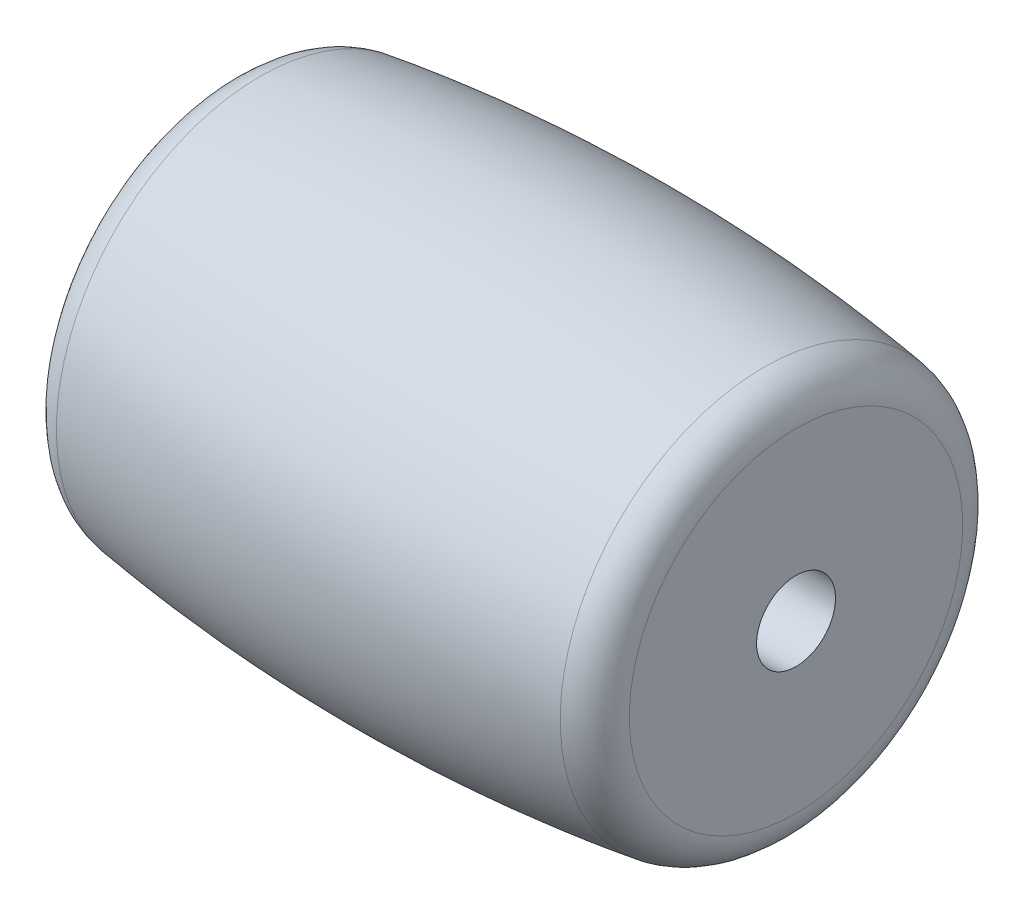
ISO-10303-21;
HEADER;
FILE_DESCRIPTION(('STEP AP214'),'2;1');
FILE_NAME('part.step','',(''),(''),'','','');
FILE_SCHEMA(('AUTOMOTIVE_DESIGN { 1 0 10303 214 1 1 1 1 }'));
ENDSEC;
DATA;
#1=APPLICATION_CONTEXT('core data for automotive mechanical design processes');
#2=APPLICATION_PROTOCOL_DEFINITION('international standard','automotive_design',2000,#1);
#3=PRODUCT_CONTEXT('',#1,'mechanical');
#4=PRODUCT('Part','Part','',(#3));
#5=PRODUCT_RELATED_PRODUCT_CATEGORY('part','',(#4));
#6=PRODUCT_DEFINITION_FORMATION('','',#4);
#7=PRODUCT_DEFINITION_CONTEXT('part definition',#1,'design');
#8=PRODUCT_DEFINITION('design','',#6,#7);
#9=PRODUCT_DEFINITION_SHAPE('','',#8);
#10=(LENGTH_UNIT() NAMED_UNIT(*) SI_UNIT(.MILLI.,.METRE.));
#11=(NAMED_UNIT(*) PLANE_ANGLE_UNIT() SI_UNIT($,.RADIAN.));
#12=(NAMED_UNIT(*) SI_UNIT($,.STERADIAN.) SOLID_ANGLE_UNIT());
#13=UNCERTAINTY_MEASURE_WITH_UNIT(LENGTH_MEASURE(1.E-05),#10,'distance_accuracy_value','');
#14=(GEOMETRIC_REPRESENTATION_CONTEXT(3) GLOBAL_UNCERTAINTY_ASSIGNED_CONTEXT((#13)) GLOBAL_UNIT_ASSIGNED_CONTEXT((#10,
#11,#12)) REPRESENTATION_CONTEXT('',''));
#15=CARTESIAN_POINT('',(0.,0.,0.));
#16=DIRECTION('',(0.,0.,1.));
#17=DIRECTION('',(1.,0.,0.));
#18=AXIS2_PLACEMENT_3D('',#15,#16,#17);
#19=CARTESIAN_POINT('',(12.065,0.,0.));
#20=DIRECTION('',(-1.,0.,0.));
#21=DIRECTION('',(0.,-1.,0.));
#22=AXIS2_PLACEMENT_3D('',#19,#20,#21);
#23=CYLINDRICAL_SURFACE('',#22,1.6764);
#24=CARTESIAN_POINT('',(12.065,0.,0.));
#25=DIRECTION('',(-1.,0.,0.));
#26=DIRECTION('',(0.,-1.,0.));
#27=AXIS2_PLACEMENT_3D('',#24,#25,#26);
#28=CIRCLE('',#27,1.6764);
#29=CARTESIAN_POINT('',(12.065,-1.6764,0.));
#30=VERTEX_POINT('',#29);
#31=EDGE_CURVE('E53',#30,#30,#28,.F.);
#32=ORIENTED_EDGE('',*,*,#31,.T.);
#33=EDGE_LOOP('',(#32));
#34=FACE_BOUND('',#33,.T.);
#35=CARTESIAN_POINT('',(-12.065,0.,0.));
#36=DIRECTION('',(-1.,0.,0.));
#37=DIRECTION('',(0.,-1.,0.));
#38=AXIS2_PLACEMENT_3D('',#35,#36,#37);
#39=CIRCLE('',#38,1.6764);
#40=CARTESIAN_POINT('',(-12.065,-1.6764,0.));
#41=VERTEX_POINT('',#40);
#42=EDGE_CURVE('E52',#41,#41,#39,.T.);
#43=ORIENTED_EDGE('',*,*,#42,.T.);
#44=EDGE_LOOP('',(#43));
#45=FACE_BOUND('',#44,.T.);
#46=ADVANCED_FACE('F16',(#34,#45),#23,.F.);
#47=CARTESIAN_POINT('',(12.065,0.,0.));
#48=DIRECTION('',(-1.,0.,0.));
#49=DIRECTION('',(0.,-1.,0.));
#50=AXIS2_PLACEMENT_3D('',#47,#48,#49);
#51=PLANE('',#50);
#52=CARTESIAN_POINT('',(12.065,0.,0.));
#53=DIRECTION('',(-1.,0.,0.));
#54=DIRECTION('',(0.,-1.,0.));
#55=AXIS2_PLACEMENT_3D('',#52,#53,#54);
#56=CIRCLE('',#55,7.0798911977823);
#57=CARTESIAN_POINT('',(12.065,-7.07989119778229,0.));
#58=VERTEX_POINT('',#57);
#59=CARTESIAN_POINT('',(12.065,7.0798911977823,0.));
#60=VERTEX_POINT('',#59);
#61=EDGE_CURVE('E44',#58,#60,#56,.T.);
#62=ORIENTED_EDGE('',*,*,#61,.F.);
#63=CARTESIAN_POINT('',(12.065,0.,0.));
#64=DIRECTION('',(-1.,0.,0.));
#65=DIRECTION('',(0.,1.,0.));
#66=AXIS2_PLACEMENT_3D('',#63,#64,#65);
#67=CIRCLE('',#66,7.0798911977823);
#68=EDGE_CURVE('E50',#60,#58,#67,.T.);
#69=ORIENTED_EDGE('',*,*,#68,.F.);
#70=EDGE_LOOP('',(#62,#69));
#71=FACE_BOUND('',#70,.T.);
#72=ORIENTED_EDGE('',*,*,#31,.F.);
#73=EDGE_LOOP('',(#72));
#74=FACE_BOUND('',#73,.T.);
#75=ADVANCED_FACE('F48',(#71,#74),#51,.F.);
#76=CARTESIAN_POINT('',(-12.065,0.,0.));
#77=DIRECTION('',(1.,0.,0.));
#78=DIRECTION('',(0.,1.,0.));
#79=AXIS2_PLACEMENT_3D('',#76,#77,#78);
#80=PLANE('',#79);
#81=CARTESIAN_POINT('',(-12.065,0.,0.));
#82=DIRECTION('',(1.,0.,0.));
#83=DIRECTION('',(0.,1.,0.));
#84=AXIS2_PLACEMENT_3D('',#81,#82,#83);
#85=CIRCLE('',#84,7.0798911977823);
#86=CARTESIAN_POINT('',(-12.065,7.07989119778229,0.));
#87=VERTEX_POINT('',#86);
#88=CARTESIAN_POINT('',(-12.065,-7.0798911977823,0.));
#89=VERTEX_POINT('',#88);
#90=EDGE_CURVE('E35',#87,#89,#85,.T.);
#91=ORIENTED_EDGE('',*,*,#90,.F.);
#92=CARTESIAN_POINT('',(-12.065,0.,0.));
#93=DIRECTION('',(1.,0.,0.));
#94=DIRECTION('',(0.,-1.,0.));
#95=AXIS2_PLACEMENT_3D('',#92,#93,#94);
#96=CIRCLE('',#95,7.0798911977823);
#97=EDGE_CURVE('E58',#89,#87,#96,.T.);
#98=ORIENTED_EDGE('',*,*,#97,.F.);
#99=EDGE_LOOP('',(#91,#98));
#100=FACE_BOUND('',#99,.T.);
#101=ORIENTED_EDGE('',*,*,#42,.F.);
#102=EDGE_LOOP('',(#101));
#103=FACE_BOUND('',#102,.T.);
#104=ADVANCED_FACE('F78',(#100,#103),#80,.F.);
#105=CARTESIAN_POINT('',(10.4775,0.,0.));
#106=DIRECTION('',(-1.,0.,0.));
#107=DIRECTION('',(0.,-1.,0.));
#108=AXIS2_PLACEMENT_3D('',#105,#106,#107);
#109=TOROIDAL_SURFACE('',#108,7.0798911977823,1.5875);
#110=ORIENTED_EDGE('',*,*,#61,.T.);
#111=ORIENTED_EDGE('',*,*,#68,.T.);
#112=EDGE_LOOP('',(#110,#111));
#113=FACE_BOUND('',#112,.T.);
#114=CARTESIAN_POINT('',(10.7004255319149,0.,0.));
#115=DIRECTION('',(-1.,0.,0.));
#116=DIRECTION('',(0.,-1.,0.));
#117=AXIS2_PLACEMENT_3D('',#114,#115,#116);
#118=CIRCLE('',#117,8.65166104646261);
#119=CARTESIAN_POINT('',(10.7004255319149,-8.6516610464626,0.));
#120=VERTEX_POINT('',#119);
#121=EDGE_CURVE('E27',#120,#120,#118,.T.);
#122=ORIENTED_EDGE('',*,*,#121,.F.);
#123=EDGE_LOOP('',(#122));
#124=FACE_BOUND('',#123,.T.);
#125=ADVANCED_FACE('F56',(#113,#124),#109,.T.);
#126=CARTESIAN_POINT('',(-10.4775,0.,0.));
#127=DIRECTION('',(1.,0.,0.));
#128=DIRECTION('',(0.,1.,0.));
#129=AXIS2_PLACEMENT_3D('',#126,#127,#128);
#130=TOROIDAL_SURFACE('',#129,7.0798911977823,1.5875);
#131=ORIENTED_EDGE('',*,*,#90,.T.);
#132=ORIENTED_EDGE('',*,*,#97,.T.);
#133=EDGE_LOOP('',(#131,#132));
#134=FACE_BOUND('',#133,.T.);
#135=CARTESIAN_POINT('',(-10.7004255319148,0.,0.));
#136=DIRECTION('',(-1.,0.,0.));
#137=DIRECTION('',(0.,-1.,0.));
#138=AXIS2_PLACEMENT_3D('',#135,#136,#137);
#139=CIRCLE('',#138,8.6516610464626);
#140=CARTESIAN_POINT('',(-10.7004255319148,-8.6516610464626,0.));
#141=VERTEX_POINT('',#140);
#142=EDGE_CURVE('E10',#141,#141,#139,.F.);
#143=ORIENTED_EDGE('',*,*,#142,.F.);
#144=EDGE_LOOP('',(#143));
#145=FACE_BOUND('',#144,.T.);
#146=ADVANCED_FACE('F77',(#134,#145),#130,.T.);
#147=CARTESIAN_POINT('',(0.,66.793291690199,0.));
#148=DIRECTION('',(0.,0.,1.));
#149=DIRECTION('',(0.,-1.,0.));
#150=AXIS2_PLACEMENT_3D('',#147,#148,#149);
#151=CIRCLE('',#150,76.2000000000076);
#152=TRIMMED_CURVE('',#151,(PARAMETER_VALUE(-0.502144567061988)),
(PARAMETER_VALUE(0.502144567061988)),.T.,.PARAMETER.);
#153=CARTESIAN_POINT('',(0.,0.,0.));
#154=DIRECTION('',(-1.,0.,0.));
#155=AXIS1_PLACEMENT('',#153,#154);
#156=SURFACE_OF_REVOLUTION('',#152,#155);
#157=ORIENTED_EDGE('',*,*,#121,.T.);
#158=EDGE_LOOP('',(#157));
#159=FACE_BOUND('',#158,.T.);
#160=ORIENTED_EDGE('',*,*,#142,.T.);
#161=EDGE_LOOP('',(#160));
#162=FACE_BOUND('',#161,.T.);
#163=ADVANCED_FACE('F119',(#159,#162),#156,.F.);
#164=CLOSED_SHELL('',(#46,#75,#104,#125,#146,#163));
#165=MANIFOLD_SOLID_BREP('B1',#164);
#166=ADVANCED_BREP_SHAPE_REPRESENTATION('',(#18,#165),#14);
#167=SHAPE_DEFINITION_REPRESENTATION(#9,#166);
ENDSEC;
END-ISO-10303-21;
